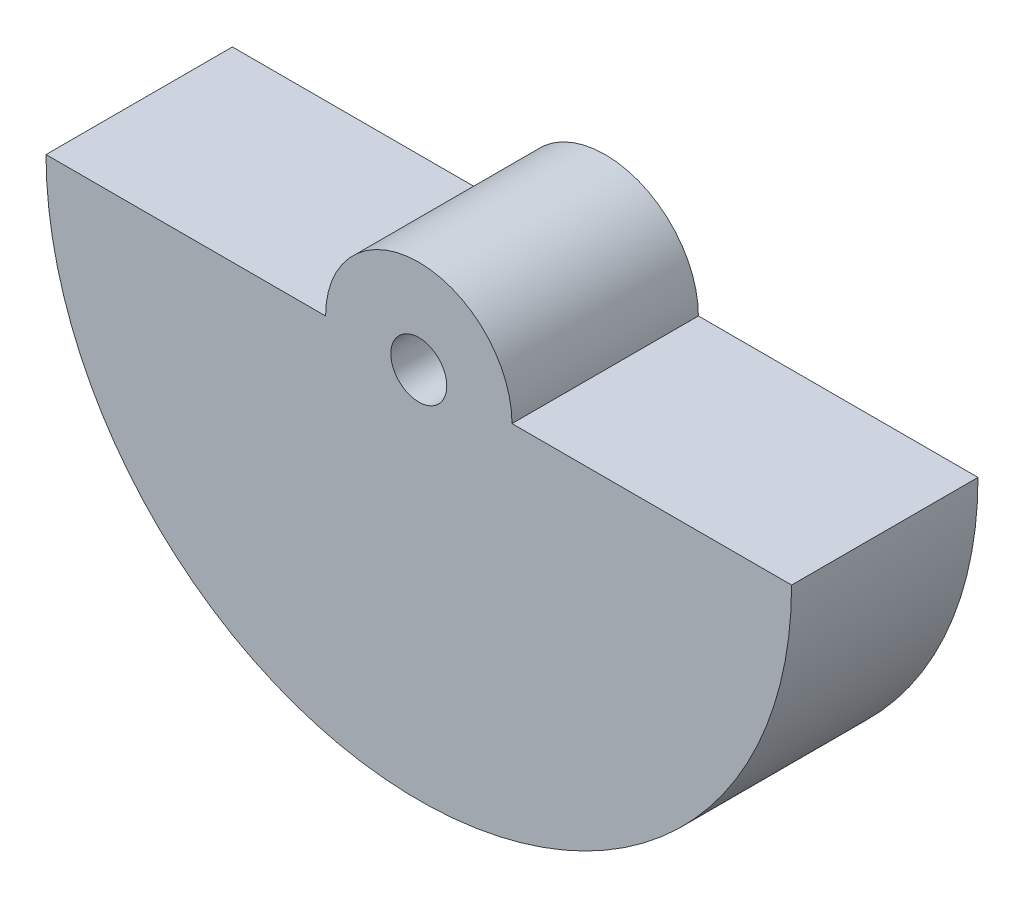
ISO-10303-21;
HEADER;
FILE_DESCRIPTION(('STEP AP214'),'2;1');
FILE_NAME('part.step','',(''),(''),'','','');
FILE_SCHEMA(('AUTOMOTIVE_DESIGN { 1 0 10303 214 1 1 1 1 }'));
ENDSEC;
DATA;
#1=APPLICATION_CONTEXT('core data for automotive mechanical design processes');
#2=APPLICATION_PROTOCOL_DEFINITION('international standard','automotive_design',2000,#1);
#3=PRODUCT_CONTEXT('',#1,'mechanical');
#4=PRODUCT('Part','Part','',(#3));
#5=PRODUCT_RELATED_PRODUCT_CATEGORY('part','',(#4));
#6=PRODUCT_DEFINITION_FORMATION('','',#4);
#7=PRODUCT_DEFINITION_CONTEXT('part definition',#1,'design');
#8=PRODUCT_DEFINITION('design','',#6,#7);
#9=PRODUCT_DEFINITION_SHAPE('','',#8);
#10=(LENGTH_UNIT() NAMED_UNIT(*) SI_UNIT(.MILLI.,.METRE.));
#11=(NAMED_UNIT(*) PLANE_ANGLE_UNIT() SI_UNIT($,.RADIAN.));
#12=(NAMED_UNIT(*) SI_UNIT($,.STERADIAN.) SOLID_ANGLE_UNIT());
#13=UNCERTAINTY_MEASURE_WITH_UNIT(LENGTH_MEASURE(1.E-05),#10,'distance_accuracy_value','');
#14=(GEOMETRIC_REPRESENTATION_CONTEXT(3) GLOBAL_UNCERTAINTY_ASSIGNED_CONTEXT((#13)) GLOBAL_UNIT_ASSIGNED_CONTEXT((#10,
#11,#12)) REPRESENTATION_CONTEXT('',''));
#15=CARTESIAN_POINT('',(0.,0.,0.));
#16=DIRECTION('',(0.,0.,1.));
#17=DIRECTION('',(1.,0.,0.));
#18=AXIS2_PLACEMENT_3D('',#15,#16,#17);
#19=CARTESIAN_POINT('',(-3.40268551102781,21.5554712532885,20.));
#20=DIRECTION('',(0.,-1.,0.));
#21=DIRECTION('',(0.,0.,-1.));
#22=AXIS2_PLACEMENT_3D('',#19,#20,#21);
#23=PLANE('',#22);
#24=DIRECTION('',(-1.,0.,0.));
#25=VECTOR('',#24,1.);
#26=CARTESIAN_POINT('',(-3.40268551102781,21.5554712532885,20.));
#27=LINE('',#26,#25);
#28=CARTESIAN_POINT('',(26.5973144889722,21.5554712532885,20.));
#29=VERTEX_POINT('',#28);
#30=CARTESIAN_POINT('',(-3.40268551102781,21.5554712532885,20.));
#31=VERTEX_POINT('',#30);
#32=EDGE_CURVE('E57',#29,#31,#27,.T.);
#33=ORIENTED_EDGE('',*,*,#32,.F.);
#34=DIRECTION('',(0.,0.,-1.));
#35=VECTOR('',#34,1.);
#36=CARTESIAN_POINT('',(26.5973144889722,21.5554712532885,48.2842712474619));
#37=LINE('',#36,#35);
#38=CARTESIAN_POINT('',(26.5973144889722,21.5554712532885,0.));
#39=VERTEX_POINT('',#38);
#40=EDGE_CURVE('E75',#29,#39,#37,.T.);
#41=ORIENTED_EDGE('',*,*,#40,.T.);
#42=DIRECTION('',(-1.,0.,0.));
#43=VECTOR('',#42,1.);
#44=CARTESIAN_POINT('',(-3.40268551102781,21.5554712532885,0.));
#45=LINE('',#44,#43);
#46=CARTESIAN_POINT('',(-3.40268551102781,21.5554712532885,0.));
#47=VERTEX_POINT('',#46);
#48=EDGE_CURVE('E71',#39,#47,#45,.T.);
#49=ORIENTED_EDGE('',*,*,#48,.T.);
#50=DIRECTION('',(0.,0.,-1.));
#51=VECTOR('',#50,1.);
#52=CARTESIAN_POINT('',(-3.40268551102781,21.5554712532885,20.));
#53=LINE('',#52,#51);
#54=EDGE_CURVE('E42',#31,#47,#53,.T.);
#55=ORIENTED_EDGE('',*,*,#54,.F.);
#56=EDGE_LOOP('',(#33,#41,#49,#55));
#57=FACE_BOUND('',#56,.T.);
#58=ADVANCED_FACE('F34',(#57),#23,.F.);
#59=CARTESIAN_POINT('',(36.5973144889722,21.5554712532885,20.));
#60=DIRECTION('',(0.,0.,-1.));
#61=DIRECTION('',(-1.,0.,0.));
#62=AXIS2_PLACEMENT_3D('',#59,#60,#61);
#63=CYLINDRICAL_SURFACE('',#62,40.);
#64=CARTESIAN_POINT('',(36.5973144889722,21.5554712532885,0.));
#65=DIRECTION('',(0.,0.,1.));
#66=DIRECTION('',(1.,0.,0.));
#67=AXIS2_PLACEMENT_3D('',#64,#65,#66);
#68=CIRCLE('',#67,40.);
#69=CARTESIAN_POINT('',(76.5973144889722,21.5554712532885,0.));
#70=VERTEX_POINT('',#69);
#71=EDGE_CURVE('E80',#47,#70,#68,.T.);
#72=ORIENTED_EDGE('',*,*,#71,.T.);
#73=DIRECTION('',(0.,0.,-1.));
#74=VECTOR('',#73,1.);
#75=CARTESIAN_POINT('',(76.5973144889722,21.5554712532885,20.));
#76=LINE('',#75,#74);
#77=CARTESIAN_POINT('',(76.5973144889722,21.5554712532885,20.));
#78=VERTEX_POINT('',#77);
#79=EDGE_CURVE('E11',#78,#70,#76,.T.);
#80=ORIENTED_EDGE('',*,*,#79,.F.);
#81=CARTESIAN_POINT('',(36.5973144889722,21.5554712532885,20.));
#82=DIRECTION('',(0.,0.,1.));
#83=DIRECTION('',(1.,0.,0.));
#84=AXIS2_PLACEMENT_3D('',#81,#82,#83);
#85=CIRCLE('',#84,40.);
#86=EDGE_CURVE('E85',#31,#78,#85,.T.);
#87=ORIENTED_EDGE('',*,*,#86,.F.);
#88=ORIENTED_EDGE('',*,*,#54,.T.);
#89=EDGE_LOOP('',(#72,#80,#87,#88));
#90=FACE_BOUND('',#89,.T.);
#91=ADVANCED_FACE('F36',(#90),#63,.T.);
#92=CARTESIAN_POINT('',(46.5973144889722,21.5554712532885,0.));
#93=VERTEX_POINT('',#92);
#94=EDGE_CURVE('E79',#70,#93,#45,.T.);
#95=ORIENTED_EDGE('',*,*,#94,.T.);
#96=DIRECTION('',(0.,0.,-1.));
#97=VECTOR('',#96,1.);
#98=CARTESIAN_POINT('',(46.5973144889722,21.5554712532885,48.2842712474619));
#99=LINE('',#98,#97);
#100=CARTESIAN_POINT('',(46.5973144889722,21.5554712532885,20.));
#101=VERTEX_POINT('',#100);
#102=EDGE_CURVE('E90',#93,#101,#99,.F.);
#103=ORIENTED_EDGE('',*,*,#102,.T.);
#104=EDGE_CURVE('E86',#78,#101,#27,.T.);
#105=ORIENTED_EDGE('',*,*,#104,.F.);
#106=ORIENTED_EDGE('',*,*,#79,.T.);
#107=EDGE_LOOP('',(#95,#103,#105,#106));
#108=FACE_BOUND('',#107,.T.);
#109=ADVANCED_FACE('F121',(#108),#23,.F.);
#110=CARTESIAN_POINT('',(36.5973144889722,21.5554712532885,20.));
#111=DIRECTION('',(0.,0.,1.));
#112=DIRECTION('',(1.,0.,0.));
#113=AXIS2_PLACEMENT_3D('',#110,#111,#112);
#114=PLANE('',#113);
#115=CARTESIAN_POINT('',(36.5973144889722,21.5554712532885,20.));
#116=DIRECTION('',(0.,0.,1.));
#117=DIRECTION('',(1.,0.,0.));
#118=AXIS2_PLACEMENT_3D('',#115,#116,#117);
#119=CIRCLE('',#118,3.);
#120=CARTESIAN_POINT('',(39.5973144889722,21.5554712532885,20.));
#121=VERTEX_POINT('',#120);
#122=EDGE_CURVE('E102',#121,#121,#119,.F.);
#123=ORIENTED_EDGE('',*,*,#122,.T.);
#124=EDGE_LOOP('',(#123));
#125=FACE_BOUND('',#124,.T.);
#126=ORIENTED_EDGE('',*,*,#104,.T.);
#127=CARTESIAN_POINT('',(36.5973144889722,21.5554712532885,20.));
#128=DIRECTION('',(0.,0.,1.));
#129=DIRECTION('',(1.,0.,0.));
#130=AXIS2_PLACEMENT_3D('',#127,#128,#129);
#131=CIRCLE('',#130,10.);
#132=EDGE_CURVE('E49',#29,#101,#131,.F.);
#133=ORIENTED_EDGE('',*,*,#132,.F.);
#134=ORIENTED_EDGE('',*,*,#32,.T.);
#135=ORIENTED_EDGE('',*,*,#86,.T.);
#136=EDGE_LOOP('',(#126,#133,#134,#135));
#137=FACE_BOUND('',#136,.T.);
#138=ADVANCED_FACE('F114',(#125,#137),#114,.T.);
#139=CARTESIAN_POINT('',(36.5973144889722,21.5554712532885,0.));
#140=DIRECTION('',(0.,0.,1.));
#141=DIRECTION('',(1.,0.,0.));
#142=AXIS2_PLACEMENT_3D('',#139,#140,#141);
#143=PLANE('',#142);
#144=CARTESIAN_POINT('',(36.5973144889722,21.5554712532885,0.));
#145=DIRECTION('',(0.,0.,-1.));
#146=DIRECTION('',(-1.,0.,0.));
#147=AXIS2_PLACEMENT_3D('',#144,#145,#146);
#148=CIRCLE('',#147,3.);
#149=CARTESIAN_POINT('',(33.5973144889722,21.5554712532885,0.));
#150=VERTEX_POINT('',#149);
#151=EDGE_CURVE('E105',#150,#150,#148,.T.);
#152=ORIENTED_EDGE('',*,*,#151,.F.);
#153=EDGE_LOOP('',(#152));
#154=FACE_BOUND('',#153,.T.);
#155=ORIENTED_EDGE('',*,*,#48,.F.);
#156=CARTESIAN_POINT('',(36.5973144889722,21.5554712532885,0.));
#157=DIRECTION('',(0.,0.,-1.));
#158=DIRECTION('',(-1.,0.,0.));
#159=AXIS2_PLACEMENT_3D('',#156,#157,#158);
#160=CIRCLE('',#159,10.);
#161=EDGE_CURVE('E100',#39,#93,#160,.T.);
#162=ORIENTED_EDGE('',*,*,#161,.T.);
#163=ORIENTED_EDGE('',*,*,#94,.F.);
#164=ORIENTED_EDGE('',*,*,#71,.F.);
#165=EDGE_LOOP('',(#155,#162,#163,#164));
#166=FACE_BOUND('',#165,.T.);
#167=ADVANCED_FACE('F87',(#154,#166),#143,.F.);
#168=CARTESIAN_POINT('',(36.5973144889722,21.5554712532885,48.2842712474619));
#169=DIRECTION('',(0.,0.,-1.));
#170=DIRECTION('',(-1.,0.,0.));
#171=AXIS2_PLACEMENT_3D('',#168,#169,#170);
#172=CYLINDRICAL_SURFACE('',#171,10.);
#173=ORIENTED_EDGE('',*,*,#40,.F.);
#174=ORIENTED_EDGE('',*,*,#132,.T.);
#175=ORIENTED_EDGE('',*,*,#102,.F.);
#176=ORIENTED_EDGE('',*,*,#161,.F.);
#177=EDGE_LOOP('',(#173,#174,#175,#176));
#178=FACE_BOUND('',#177,.T.);
#179=ADVANCED_FACE('F113',(#178),#172,.T.);
#180=CARTESIAN_POINT('',(36.5973144889722,21.5554712532885,28.4852813742386));
#181=DIRECTION('',(0.,0.,-1.));
#182=DIRECTION('',(-1.,0.,0.));
#183=AXIS2_PLACEMENT_3D('',#180,#181,#182);
#184=CYLINDRICAL_SURFACE('',#183,3.);
#185=ORIENTED_EDGE('',*,*,#151,.T.);
#186=EDGE_LOOP('',(#185));
#187=FACE_BOUND('',#186,.T.);
#188=ORIENTED_EDGE('',*,*,#122,.F.);
#189=EDGE_LOOP('',(#188));
#190=FACE_BOUND('',#189,.T.);
#191=ADVANCED_FACE('F109',(#187,#190),#184,.F.);
#192=CLOSED_SHELL('',(#58,#91,#109,#138,#167,#179,#191));
#193=MANIFOLD_SOLID_BREP('B2',#192);
#194=ADVANCED_BREP_SHAPE_REPRESENTATION('',(#18,#193),#14);
#195=SHAPE_DEFINITION_REPRESENTATION(#9,#194);
ENDSEC;
END-ISO-10303-21;
